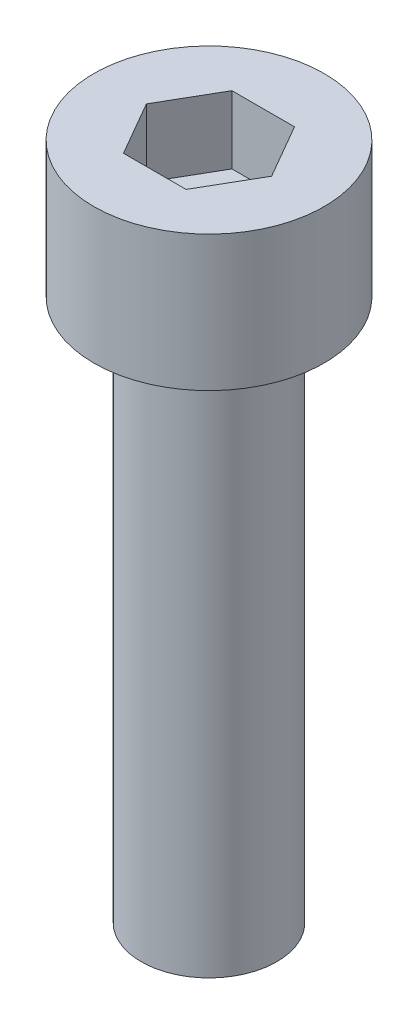
ISO-10303-21;
HEADER;
FILE_DESCRIPTION(('STEP AP214'),'2;1');
FILE_NAME('part.step','',(''),(''),'','','');
FILE_SCHEMA(('AUTOMOTIVE_DESIGN { 1 0 10303 214 1 1 1 1 }'));
ENDSEC;
DATA;
#1=APPLICATION_CONTEXT('core data for automotive mechanical design processes');
#2=APPLICATION_PROTOCOL_DEFINITION('international standard','automotive_design',2000,#1);
#3=PRODUCT_CONTEXT('',#1,'mechanical');
#4=PRODUCT('Part','Part','',(#3));
#5=PRODUCT_RELATED_PRODUCT_CATEGORY('part','',(#4));
#6=PRODUCT_DEFINITION_FORMATION('','',#4);
#7=PRODUCT_DEFINITION_CONTEXT('part definition',#1,'design');
#8=PRODUCT_DEFINITION('design','',#6,#7);
#9=PRODUCT_DEFINITION_SHAPE('','',#8);
#10=(LENGTH_UNIT() NAMED_UNIT(*) SI_UNIT(.MILLI.,.METRE.));
#11=(NAMED_UNIT(*) PLANE_ANGLE_UNIT() SI_UNIT($,.RADIAN.));
#12=(NAMED_UNIT(*) SI_UNIT($,.STERADIAN.) SOLID_ANGLE_UNIT());
#13=UNCERTAINTY_MEASURE_WITH_UNIT(LENGTH_MEASURE(1.E-05),#10,'distance_accuracy_value','');
#14=(GEOMETRIC_REPRESENTATION_CONTEXT(3) GLOBAL_UNCERTAINTY_ASSIGNED_CONTEXT((#13)) GLOBAL_UNIT_ASSIGNED_CONTEXT((#10,
#11,#12)) REPRESENTATION_CONTEXT('',''));
#15=CARTESIAN_POINT('',(0.,0.,0.));
#16=DIRECTION('',(0.,0.,1.));
#17=DIRECTION('',(1.,0.,0.));
#18=AXIS2_PLACEMENT_3D('',#15,#16,#17);
#19=CARTESIAN_POINT('',(0.,5.,0.));
#20=DIRECTION('',(0.,-1.,0.));
#21=DIRECTION('',(0.,0.,-1.));
#22=AXIS2_PLACEMENT_3D('',#19,#20,#21);
#23=CYLINDRICAL_SURFACE('',#22,4.25);
#24=CARTESIAN_POINT('',(0.,5.,0.));
#25=DIRECTION('',(0.,1.,0.));
#26=DIRECTION('',(0.,0.,1.));
#27=AXIS2_PLACEMENT_3D('',#24,#25,#26);
#28=CIRCLE('',#27,4.25);
#29=CARTESIAN_POINT('',(0.,5.,4.25));
#30=VERTEX_POINT('',#29);
#31=EDGE_CURVE('E43',#30,#30,#28,.T.);
#32=ORIENTED_EDGE('',*,*,#31,.F.);
#33=EDGE_LOOP('',(#32));
#34=FACE_BOUND('',#33,.T.);
#35=CARTESIAN_POINT('',(0.,0.,0.));
#36=DIRECTION('',(0.,1.,0.));
#37=DIRECTION('',(0.,0.,1.));
#38=AXIS2_PLACEMENT_3D('',#35,#36,#37);
#39=CIRCLE('',#38,4.25);
#40=CARTESIAN_POINT('',(0.,0.,4.25));
#41=VERTEX_POINT('',#40);
#42=EDGE_CURVE('E38',#41,#41,#39,.T.);
#43=ORIENTED_EDGE('',*,*,#42,.T.);
#44=EDGE_LOOP('',(#43));
#45=FACE_BOUND('',#44,.T.);
#46=ADVANCED_FACE('F35',(#34,#45),#23,.T.);
#47=CARTESIAN_POINT('',(0.,5.,0.));
#48=DIRECTION('',(0.,1.,0.));
#49=DIRECTION('',(0.,0.,1.));
#50=AXIS2_PLACEMENT_3D('',#47,#48,#49);
#51=PLANE('',#50);
#52=DIRECTION('',(0.5,0.,-0.866025403784439));
#53=VECTOR('',#52,1.);
#54=CARTESIAN_POINT('',(1.15470053837925,5.,2.));
#55=LINE('',#54,#53);
#56=CARTESIAN_POINT('',(1.15470053837925,5.,2.));
#57=VERTEX_POINT('',#56);
#58=CARTESIAN_POINT('',(2.3094010767585,5.,0.));
#59=VERTEX_POINT('',#58);
#60=EDGE_CURVE('E51',#57,#59,#55,.T.);
#61=ORIENTED_EDGE('',*,*,#60,.F.);
#62=DIRECTION('',(1.,0.,0.));
#63=VECTOR('',#62,1.);
#64=CARTESIAN_POINT('',(-1.15470053837925,5.,2.));
#65=LINE('',#64,#63);
#66=CARTESIAN_POINT('',(-1.15470053837925,5.,2.));
#67=VERTEX_POINT('',#66);
#68=EDGE_CURVE('E135',#67,#57,#65,.T.);
#69=ORIENTED_EDGE('',*,*,#68,.F.);
#70=DIRECTION('',(0.5,0.,0.866025403784438));
#71=VECTOR('',#70,1.);
#72=CARTESIAN_POINT('',(-2.3094010767585,5.,0.));
#73=LINE('',#72,#71);
#74=CARTESIAN_POINT('',(-2.3094010767585,5.,0.));
#75=VERTEX_POINT('',#74);
#76=EDGE_CURVE('E133',#75,#67,#73,.T.);
#77=ORIENTED_EDGE('',*,*,#76,.F.);
#78=DIRECTION('',(-0.5,0.,0.866025403784439));
#79=VECTOR('',#78,1.);
#80=CARTESIAN_POINT('',(-1.15470053837925,5.,-2.));
#81=LINE('',#80,#79);
#82=CARTESIAN_POINT('',(-1.15470053837925,5.,-2.));
#83=VERTEX_POINT('',#82);
#84=EDGE_CURVE('E99',#83,#75,#81,.T.);
#85=ORIENTED_EDGE('',*,*,#84,.F.);
#86=DIRECTION('',(-1.,0.,0.));
#87=VECTOR('',#86,1.);
#88=CARTESIAN_POINT('',(1.15470053837925,5.,-2.));
#89=LINE('',#88,#87);
#90=CARTESIAN_POINT('',(1.15470053837925,5.,-2.));
#91=VERTEX_POINT('',#90);
#92=EDGE_CURVE('E129',#91,#83,#89,.T.);
#93=ORIENTED_EDGE('',*,*,#92,.F.);
#94=DIRECTION('',(-0.5,0.,-0.866025403784438));
#95=VECTOR('',#94,1.);
#96=CARTESIAN_POINT('',(2.3094010767585,5.,0.));
#97=LINE('',#96,#95);
#98=EDGE_CURVE('E125',#59,#91,#97,.T.);
#99=ORIENTED_EDGE('',*,*,#98,.F.);
#100=EDGE_LOOP('',(#61,#69,#77,#85,#93,#99));
#101=FACE_BOUND('',#100,.T.);
#102=ORIENTED_EDGE('',*,*,#31,.T.);
#103=EDGE_LOOP('',(#102));
#104=FACE_BOUND('',#103,.T.);
#105=ADVANCED_FACE('F153',(#101,#104),#51,.T.);
#106=CARTESIAN_POINT('',(0.,0.,0.));
#107=DIRECTION('',(0.,1.,0.));
#108=DIRECTION('',(0.,0.,1.));
#109=AXIS2_PLACEMENT_3D('',#106,#107,#108);
#110=PLANE('',#109);
#111=CARTESIAN_POINT('',(0.,0.,0.));
#112=DIRECTION('',(0.,-1.,0.));
#113=DIRECTION('',(0.,0.,-1.));
#114=AXIS2_PLACEMENT_3D('',#111,#112,#113);
#115=CIRCLE('',#114,2.5);
#116=CARTESIAN_POINT('',(0.,0.,-2.5));
#117=VERTEX_POINT('',#116);
#118=EDGE_CURVE('E11',#117,#117,#115,.T.);
#119=ORIENTED_EDGE('',*,*,#118,.F.);
#120=EDGE_LOOP('',(#119));
#121=FACE_BOUND('',#120,.T.);
#122=ORIENTED_EDGE('',*,*,#42,.F.);
#123=EDGE_LOOP('',(#122));
#124=FACE_BOUND('',#123,.T.);
#125=ADVANCED_FACE('F150',(#121,#124),#110,.F.);
#126=CARTESIAN_POINT('',(1.15470053837925,2.5,2.));
#127=DIRECTION('',(0.866025403784439,0.,0.5));
#128=DIRECTION('',(0.5,0.,-0.866025403784439));
#129=AXIS2_PLACEMENT_3D('',#126,#127,#128);
#130=PLANE('',#129);
#131=ORIENTED_EDGE('',*,*,#60,.T.);
#132=DIRECTION('',(0.,1.,0.));
#133=VECTOR('',#132,1.);
#134=CARTESIAN_POINT('',(2.3094010767585,2.5,0.));
#135=LINE('',#134,#133);
#136=CARTESIAN_POINT('',(2.3094010767585,2.5,0.));
#137=VERTEX_POINT('',#136);
#138=EDGE_CURVE('E81',#137,#59,#135,.T.);
#139=ORIENTED_EDGE('',*,*,#138,.F.);
#140=DIRECTION('',(0.5,0.,-0.866025403784439));
#141=VECTOR('',#140,1.);
#142=CARTESIAN_POINT('',(1.15470053837925,2.5,2.));
#143=LINE('',#142,#141);
#144=CARTESIAN_POINT('',(1.15470053837925,2.5,2.));
#145=VERTEX_POINT('',#144);
#146=EDGE_CURVE('E137',#145,#137,#143,.T.);
#147=ORIENTED_EDGE('',*,*,#146,.F.);
#148=DIRECTION('',(0.,1.,0.));
#149=VECTOR('',#148,1.);
#150=CARTESIAN_POINT('',(1.15470053837925,2.5,2.));
#151=LINE('',#150,#149);
#152=EDGE_CURVE('E59',#145,#57,#151,.T.);
#153=ORIENTED_EDGE('',*,*,#152,.T.);
#154=EDGE_LOOP('',(#131,#139,#147,#153));
#155=FACE_BOUND('',#154,.T.);
#156=ADVANCED_FACE('F152',(#155),#130,.F.);
#157=CARTESIAN_POINT('',(-1.15470053837925,2.5,2.));
#158=DIRECTION('',(0.,0.,1.));
#159=DIRECTION('',(1.,0.,0.));
#160=AXIS2_PLACEMENT_3D('',#157,#158,#159);
#161=PLANE('',#160);
#162=ORIENTED_EDGE('',*,*,#68,.T.);
#163=ORIENTED_EDGE('',*,*,#152,.F.);
#164=DIRECTION('',(1.,0.,0.));
#165=VECTOR('',#164,1.);
#166=CARTESIAN_POINT('',(-1.15470053837925,2.5,2.));
#167=LINE('',#166,#165);
#168=CARTESIAN_POINT('',(-1.15470053837925,2.5,2.));
#169=VERTEX_POINT('',#168);
#170=EDGE_CURVE('E111',#169,#145,#167,.T.);
#171=ORIENTED_EDGE('',*,*,#170,.F.);
#172=DIRECTION('',(0.,1.,0.));
#173=VECTOR('',#172,1.);
#174=CARTESIAN_POINT('',(-1.15470053837925,2.5,2.));
#175=LINE('',#174,#173);
#176=EDGE_CURVE('E103',#169,#67,#175,.T.);
#177=ORIENTED_EDGE('',*,*,#176,.T.);
#178=EDGE_LOOP('',(#162,#163,#171,#177));
#179=FACE_BOUND('',#178,.T.);
#180=ADVANCED_FACE('F159',(#179),#161,.F.);
#181=CARTESIAN_POINT('',(-2.3094010767585,2.5,0.));
#182=DIRECTION('',(-0.866025403784439,0.,0.5));
#183=DIRECTION('',(0.5,0.,0.866025403784439));
#184=AXIS2_PLACEMENT_3D('',#181,#182,#183);
#185=PLANE('',#184);
#186=ORIENTED_EDGE('',*,*,#76,.T.);
#187=ORIENTED_EDGE('',*,*,#176,.F.);
#188=DIRECTION('',(0.5,0.,0.866025403784438));
#189=VECTOR('',#188,1.);
#190=CARTESIAN_POINT('',(-2.3094010767585,2.5,0.));
#191=LINE('',#190,#189);
#192=CARTESIAN_POINT('',(-2.3094010767585,2.5,0.));
#193=VERTEX_POINT('',#192);
#194=EDGE_CURVE('E107',#193,#169,#191,.T.);
#195=ORIENTED_EDGE('',*,*,#194,.F.);
#196=DIRECTION('',(0.,1.,0.));
#197=VECTOR('',#196,1.);
#198=CARTESIAN_POINT('',(-2.3094010767585,2.5,0.));
#199=LINE('',#198,#197);
#200=EDGE_CURVE('E92',#193,#75,#199,.T.);
#201=ORIENTED_EDGE('',*,*,#200,.T.);
#202=EDGE_LOOP('',(#186,#187,#195,#201));
#203=FACE_BOUND('',#202,.T.);
#204=ADVANCED_FACE('F108',(#203),#185,.F.);
#205=CARTESIAN_POINT('',(-1.15470053837925,2.5,-2.));
#206=DIRECTION('',(-0.866025403784439,0.,-0.5));
#207=DIRECTION('',(-0.5,0.,0.866025403784439));
#208=AXIS2_PLACEMENT_3D('',#205,#206,#207);
#209=PLANE('',#208);
#210=ORIENTED_EDGE('',*,*,#84,.T.);
#211=ORIENTED_EDGE('',*,*,#200,.F.);
#212=DIRECTION('',(-0.5,0.,0.866025403784439));
#213=VECTOR('',#212,1.);
#214=CARTESIAN_POINT('',(-1.15470053837925,2.5,-2.));
#215=LINE('',#214,#213);
#216=CARTESIAN_POINT('',(-1.15470053837925,2.5,-2.));
#217=VERTEX_POINT('',#216);
#218=EDGE_CURVE('E96',#217,#193,#215,.T.);
#219=ORIENTED_EDGE('',*,*,#218,.F.);
#220=DIRECTION('',(0.,1.,0.));
#221=VECTOR('',#220,1.);
#222=CARTESIAN_POINT('',(-1.15470053837925,2.5,-2.));
#223=LINE('',#222,#221);
#224=EDGE_CURVE('E104',#217,#83,#223,.T.);
#225=ORIENTED_EDGE('',*,*,#224,.T.);
#226=EDGE_LOOP('',(#210,#211,#219,#225));
#227=FACE_BOUND('',#226,.T.);
#228=ADVANCED_FACE('F94',(#227),#209,.F.);
#229=CARTESIAN_POINT('',(1.15470053837925,2.5,-2.));
#230=DIRECTION('',(0.,0.,-1.));
#231=DIRECTION('',(-1.,0.,0.));
#232=AXIS2_PLACEMENT_3D('',#229,#230,#231);
#233=PLANE('',#232);
#234=ORIENTED_EDGE('',*,*,#92,.T.);
#235=ORIENTED_EDGE('',*,*,#224,.F.);
#236=DIRECTION('',(-1.,0.,0.));
#237=VECTOR('',#236,1.);
#238=CARTESIAN_POINT('',(1.15470053837925,2.5,-2.));
#239=LINE('',#238,#237);
#240=CARTESIAN_POINT('',(1.15470053837925,2.5,-2.));
#241=VERTEX_POINT('',#240);
#242=EDGE_CURVE('E117',#241,#217,#239,.T.);
#243=ORIENTED_EDGE('',*,*,#242,.F.);
#244=DIRECTION('',(0.,1.,0.));
#245=VECTOR('',#244,1.);
#246=CARTESIAN_POINT('',(1.15470053837925,2.5,-2.));
#247=LINE('',#246,#245);
#248=EDGE_CURVE('E141',#241,#91,#247,.T.);
#249=ORIENTED_EDGE('',*,*,#248,.T.);
#250=EDGE_LOOP('',(#234,#235,#243,#249));
#251=FACE_BOUND('',#250,.T.);
#252=ADVANCED_FACE('F204',(#251),#233,.F.);
#253=CARTESIAN_POINT('',(2.3094010767585,2.5,0.));
#254=DIRECTION('',(0.866025403784438,0.,-0.5));
#255=DIRECTION('',(-0.5,0.,-0.866025403784439));
#256=AXIS2_PLACEMENT_3D('',#253,#254,#255);
#257=PLANE('',#256);
#258=ORIENTED_EDGE('',*,*,#98,.T.);
#259=ORIENTED_EDGE('',*,*,#248,.F.);
#260=DIRECTION('',(-0.5,0.,-0.866025403784438));
#261=VECTOR('',#260,1.);
#262=CARTESIAN_POINT('',(2.3094010767585,2.5,0.));
#263=LINE('',#262,#261);
#264=EDGE_CURVE('E119',#137,#241,#263,.T.);
#265=ORIENTED_EDGE('',*,*,#264,.F.);
#266=ORIENTED_EDGE('',*,*,#138,.T.);
#267=EDGE_LOOP('',(#258,#259,#265,#266));
#268=FACE_BOUND('',#267,.T.);
#269=ADVANCED_FACE('F213',(#268),#257,.F.);
#270=CARTESIAN_POINT('',(0.,2.5,0.));
#271=DIRECTION('',(0.,1.,0.));
#272=DIRECTION('',(0.,0.,1.));
#273=AXIS2_PLACEMENT_3D('',#270,#271,#272);
#274=PLANE('',#273);
#275=ORIENTED_EDGE('',*,*,#146,.T.);
#276=ORIENTED_EDGE('',*,*,#264,.T.);
#277=ORIENTED_EDGE('',*,*,#242,.T.);
#278=ORIENTED_EDGE('',*,*,#218,.T.);
#279=ORIENTED_EDGE('',*,*,#194,.T.);
#280=ORIENTED_EDGE('',*,*,#170,.T.);
#281=EDGE_LOOP('',(#275,#276,#277,#278,#279,#280));
#282=FACE_BOUND('',#281,.T.);
#283=ADVANCED_FACE('F114',(#282),#274,.T.);
#284=CARTESIAN_POINT('',(0.,-20.,0.));
#285=DIRECTION('',(0.,1.,0.));
#286=DIRECTION('',(0.,0.,1.));
#287=AXIS2_PLACEMENT_3D('',#284,#285,#286);
#288=CYLINDRICAL_SURFACE('',#287,2.5);
#289=CARTESIAN_POINT('',(0.,-20.,0.));
#290=DIRECTION('',(0.,-1.,0.));
#291=DIRECTION('',(0.,0.,-1.));
#292=AXIS2_PLACEMENT_3D('',#289,#290,#291);
#293=CIRCLE('',#292,2.5);
#294=CARTESIAN_POINT('',(0.,-20.,-2.5));
#295=VERTEX_POINT('',#294);
#296=EDGE_CURVE('E126',#295,#295,#293,.T.);
#297=ORIENTED_EDGE('',*,*,#296,.F.);
#298=EDGE_LOOP('',(#297));
#299=FACE_BOUND('',#298,.T.);
#300=ORIENTED_EDGE('',*,*,#118,.T.);
#301=EDGE_LOOP('',(#300));
#302=FACE_BOUND('',#301,.T.);
#303=ADVANCED_FACE('F231',(#299,#302),#288,.T.);
#304=CARTESIAN_POINT('',(0.,-20.,0.));
#305=DIRECTION('',(0.,-1.,0.));
#306=DIRECTION('',(0.,0.,-1.));
#307=AXIS2_PLACEMENT_3D('',#304,#305,#306);
#308=PLANE('',#307);
#309=ORIENTED_EDGE('',*,*,#296,.T.);
#310=EDGE_LOOP('',(#309));
#311=FACE_BOUND('',#310,.T.);
#312=ADVANCED_FACE('F244',(#311),#308,.T.);
#313=CLOSED_SHELL('',(#46,#105,#125,#156,#180,#204,#228,#252,#269,#283,#303,#312));
#314=MANIFOLD_SOLID_BREP('B2',#313);
#315=ADVANCED_BREP_SHAPE_REPRESENTATION('',(#18,#314),#14);
#316=SHAPE_DEFINITION_REPRESENTATION(#9,#315);
ENDSEC;
END-ISO-10303-21;
